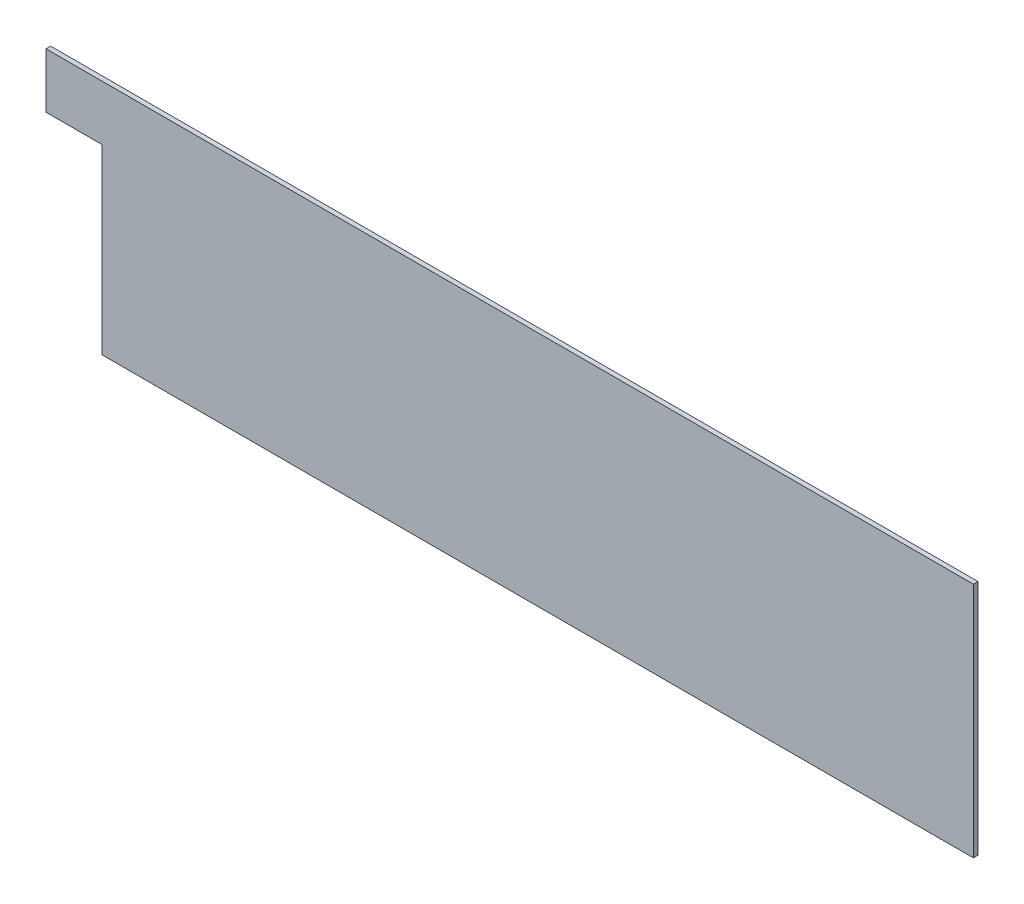
ISO-10303-21;
HEADER;
FILE_DESCRIPTION(('STEP AP214'),'2;1');
FILE_NAME('part.step','',(''),(''),'','','');
FILE_SCHEMA(('AUTOMOTIVE_DESIGN { 1 0 10303 214 1 1 1 1 }'));
ENDSEC;
DATA;
#1=APPLICATION_CONTEXT('core data for automotive mechanical design processes');
#2=APPLICATION_PROTOCOL_DEFINITION('international standard','automotive_design',2000,#1);
#3=PRODUCT_CONTEXT('',#1,'mechanical');
#4=PRODUCT('Part','Part','',(#3));
#5=PRODUCT_RELATED_PRODUCT_CATEGORY('part','',(#4));
#6=PRODUCT_DEFINITION_FORMATION('','',#4);
#7=PRODUCT_DEFINITION_CONTEXT('part definition',#1,'design');
#8=PRODUCT_DEFINITION('design','',#6,#7);
#9=PRODUCT_DEFINITION_SHAPE('','',#8);
#10=(LENGTH_UNIT() NAMED_UNIT(*) SI_UNIT(.MILLI.,.METRE.));
#11=(NAMED_UNIT(*) PLANE_ANGLE_UNIT() SI_UNIT($,.RADIAN.));
#12=(NAMED_UNIT(*) SI_UNIT($,.STERADIAN.) SOLID_ANGLE_UNIT());
#13=UNCERTAINTY_MEASURE_WITH_UNIT(LENGTH_MEASURE(1.E-05),#10,'distance_accuracy_value','');
#14=(GEOMETRIC_REPRESENTATION_CONTEXT(3) GLOBAL_UNCERTAINTY_ASSIGNED_CONTEXT((#13)) GLOBAL_UNIT_ASSIGNED_CONTEXT((#10,
#11,#12)) REPRESENTATION_CONTEXT('',''));
#15=CARTESIAN_POINT('',(0.,0.,0.));
#16=DIRECTION('',(0.,0.,1.));
#17=DIRECTION('',(1.,0.,0.));
#18=AXIS2_PLACEMENT_3D('',#15,#16,#17);
#19=CARTESIAN_POINT('',(6025.,-1.33622893420292E-13,-30.));
#20=DIRECTION('',(0.,1.,0.));
#21=DIRECTION('',(-1.,0.,0.));
#22=AXIS2_PLACEMENT_3D('',#19,#20,#21);
#23=PLANE('',#22);
#24=DIRECTION('',(-1.,0.,0.));
#25=VECTOR('',#24,1.);
#26=CARTESIAN_POINT('',(6025.,-1.33622893420292E-13,0.));
#27=LINE('',#26,#25);
#28=CARTESIAN_POINT('',(6025.,-1.33622893420292E-13,0.));
#29=VERTEX_POINT('',#28);
#30=CARTESIAN_POINT('',(0.,0.,0.));
#31=VERTEX_POINT('',#30);
#32=EDGE_CURVE('E118',#29,#31,#27,.T.);
#33=ORIENTED_EDGE('',*,*,#32,.F.);
#34=DIRECTION('',(0.,0.,1.));
#35=VECTOR('',#34,1.);
#36=CARTESIAN_POINT('',(6025.,-1.33622893420292E-13,-30.));
#37=LINE('',#36,#35);
#38=CARTESIAN_POINT('',(6025.,-1.33622893420292E-13,-30.));
#39=VERTEX_POINT('',#38);
#40=EDGE_CURVE('E45',#39,#29,#37,.T.);
#41=ORIENTED_EDGE('',*,*,#40,.F.);
#42=DIRECTION('',(-1.,0.,0.));
#43=VECTOR('',#42,1.);
#44=CARTESIAN_POINT('',(6025.,-1.33622893420292E-13,-30.));
#45=LINE('',#44,#43);
#46=CARTESIAN_POINT('',(0.,0.,-30.));
#47=VERTEX_POINT('',#46);
#48=EDGE_CURVE('E120',#39,#47,#45,.T.);
#49=ORIENTED_EDGE('',*,*,#48,.T.);
#50=DIRECTION('',(0.,0.,1.));
#51=VECTOR('',#50,1.);
#52=CARTESIAN_POINT('',(0.,0.,-30.));
#53=LINE('',#52,#51);
#54=EDGE_CURVE('E85',#47,#31,#53,.T.);
#55=ORIENTED_EDGE('',*,*,#54,.T.);
#56=EDGE_LOOP('',(#33,#41,#49,#55));
#57=FACE_BOUND('',#56,.T.);
#58=ADVANCED_FACE('F38',(#57),#23,.T.);
#59=CARTESIAN_POINT('',(6025.,-1540.,-30.));
#60=DIRECTION('',(1.,0.,0.));
#61=DIRECTION('',(0.,0.,-1.));
#62=AXIS2_PLACEMENT_3D('',#59,#60,#61);
#63=PLANE('',#62);
#64=DIRECTION('',(0.,1.,0.));
#65=VECTOR('',#64,1.);
#66=CARTESIAN_POINT('',(6025.,-1540.,0.));
#67=LINE('',#66,#65);
#68=CARTESIAN_POINT('',(6025.,-1540.,0.));
#69=VERTEX_POINT('',#68);
#70=EDGE_CURVE('E122',#69,#29,#67,.T.);
#71=ORIENTED_EDGE('',*,*,#70,.F.);
#72=DIRECTION('',(0.,0.,1.));
#73=VECTOR('',#72,1.);
#74=CARTESIAN_POINT('',(6025.,-1540.,-30.));
#75=LINE('',#74,#73);
#76=CARTESIAN_POINT('',(6025.,-1540.,-30.));
#77=VERTEX_POINT('',#76);
#78=EDGE_CURVE('E139',#77,#69,#75,.T.);
#79=ORIENTED_EDGE('',*,*,#78,.F.);
#80=DIRECTION('',(0.,1.,0.));
#81=VECTOR('',#80,1.);
#82=CARTESIAN_POINT('',(6025.,-1540.,-30.));
#83=LINE('',#82,#81);
#84=EDGE_CURVE('E125',#77,#39,#83,.T.);
#85=ORIENTED_EDGE('',*,*,#84,.T.);
#86=ORIENTED_EDGE('',*,*,#40,.T.);
#87=EDGE_LOOP('',(#71,#79,#85,#86));
#88=FACE_BOUND('',#87,.T.);
#89=ADVANCED_FACE('F146',(#88),#63,.T.);
#90=CARTESIAN_POINT('',(365.,-1540.,-30.));
#91=DIRECTION('',(0.,-1.,0.));
#92=DIRECTION('',(0.,0.,-1.));
#93=AXIS2_PLACEMENT_3D('',#90,#91,#92);
#94=PLANE('',#93);
#95=DIRECTION('',(1.,0.,0.));
#96=VECTOR('',#95,1.);
#97=CARTESIAN_POINT('',(365.,-1540.,0.));
#98=LINE('',#97,#96);
#99=CARTESIAN_POINT('',(365.,-1540.,0.));
#100=VERTEX_POINT('',#99);
#101=EDGE_CURVE('E133',#100,#69,#98,.T.);
#102=ORIENTED_EDGE('',*,*,#101,.F.);
#103=DIRECTION('',(0.,0.,1.));
#104=VECTOR('',#103,1.);
#105=CARTESIAN_POINT('',(365.,-1540.,-30.));
#106=LINE('',#105,#104);
#107=CARTESIAN_POINT('',(365.,-1540.,-30.));
#108=VERTEX_POINT('',#107);
#109=EDGE_CURVE('E141',#108,#100,#106,.T.);
#110=ORIENTED_EDGE('',*,*,#109,.F.);
#111=DIRECTION('',(1.,0.,0.));
#112=VECTOR('',#111,1.);
#113=CARTESIAN_POINT('',(365.,-1540.,-30.));
#114=LINE('',#113,#112);
#115=EDGE_CURVE('E105',#108,#77,#114,.T.);
#116=ORIENTED_EDGE('',*,*,#115,.T.);
#117=ORIENTED_EDGE('',*,*,#78,.T.);
#118=EDGE_LOOP('',(#102,#110,#116,#117));
#119=FACE_BOUND('',#118,.T.);
#120=ADVANCED_FACE('F148',(#119),#94,.T.);
#121=CARTESIAN_POINT('',(365.,-1015.,-30.));
#122=DIRECTION('',(-1.,0.,0.));
#123=DIRECTION('',(0.,-1.,0.));
#124=AXIS2_PLACEMENT_3D('',#121,#122,#123);
#125=PLANE('',#124);
#126=DIRECTION('',(0.,-1.,0.));
#127=VECTOR('',#126,1.);
#128=CARTESIAN_POINT('',(365.,-1015.,0.));
#129=LINE('',#128,#127);
#130=CARTESIAN_POINT('',(365.,-357.,0.));
#131=VERTEX_POINT('',#130);
#132=EDGE_CURVE('E52',#131,#100,#129,.T.);
#133=ORIENTED_EDGE('',*,*,#132,.F.);
#134=DIRECTION('',(0.,0.,1.));
#135=VECTOR('',#134,1.);
#136=CARTESIAN_POINT('',(365.,-357.,-30.));
#137=LINE('',#136,#135);
#138=CARTESIAN_POINT('',(365.,-357.,-30.));
#139=VERTEX_POINT('',#138);
#140=EDGE_CURVE('E108',#139,#131,#137,.T.);
#141=ORIENTED_EDGE('',*,*,#140,.F.);
#142=DIRECTION('',(0.,-1.,0.));
#143=VECTOR('',#142,1.);
#144=CARTESIAN_POINT('',(365.,-1015.,-30.));
#145=LINE('',#144,#143);
#146=EDGE_CURVE('E99',#139,#108,#145,.T.);
#147=ORIENTED_EDGE('',*,*,#146,.T.);
#148=ORIENTED_EDGE('',*,*,#109,.T.);
#149=EDGE_LOOP('',(#133,#141,#147,#148));
#150=FACE_BOUND('',#149,.T.);
#151=ADVANCED_FACE('F109',(#150),#125,.T.);
#152=CARTESIAN_POINT('',(0.,0.,-30.));
#153=DIRECTION('',(-1.,0.,0.));
#154=DIRECTION('',(0.,0.,1.));
#155=AXIS2_PLACEMENT_3D('',#152,#153,#154);
#156=PLANE('',#155);
#157=DIRECTION('',(0.,0.,1.));
#158=VECTOR('',#157,1.);
#159=CARTESIAN_POINT('',(0.,-357.,-30.));
#160=LINE('',#159,#158);
#161=CARTESIAN_POINT('',(0.,-357.,-30.));
#162=VERTEX_POINT('',#161);
#163=CARTESIAN_POINT('',(0.,-357.,0.));
#164=VERTEX_POINT('',#163);
#165=EDGE_CURVE('E112',#162,#164,#160,.T.);
#166=ORIENTED_EDGE('',*,*,#165,.T.);
#167=DIRECTION('',(0.,-1.,0.));
#168=VECTOR('',#167,1.);
#169=CARTESIAN_POINT('',(0.,0.,0.));
#170=LINE('',#169,#168);
#171=EDGE_CURVE('E129',#31,#164,#170,.T.);
#172=ORIENTED_EDGE('',*,*,#171,.F.);
#173=ORIENTED_EDGE('',*,*,#54,.F.);
#174=DIRECTION('',(0.,-1.,0.));
#175=VECTOR('',#174,1.);
#176=CARTESIAN_POINT('',(0.,0.,-30.));
#177=LINE('',#176,#175);
#178=EDGE_CURVE('E106',#47,#162,#177,.T.);
#179=ORIENTED_EDGE('',*,*,#178,.T.);
#180=EDGE_LOOP('',(#166,#172,#173,#179));
#181=FACE_BOUND('',#180,.T.);
#182=ADVANCED_FACE('F142',(#181),#156,.T.);
#183=CARTESIAN_POINT('',(0.,0.,-30.));
#184=DIRECTION('',(0.,0.,1.));
#185=DIRECTION('',(1.,0.,0.));
#186=AXIS2_PLACEMENT_3D('',#183,#184,#185);
#187=PLANE('',#186);
#188=ORIENTED_EDGE('',*,*,#146,.F.);
#189=DIRECTION('',(-1.,0.,0.));
#190=VECTOR('',#189,1.);
#191=CARTESIAN_POINT('',(365.,-357.,-30.));
#192=LINE('',#191,#190);
#193=EDGE_CURVE('E102',#139,#162,#192,.T.);
#194=ORIENTED_EDGE('',*,*,#193,.T.);
#195=ORIENTED_EDGE('',*,*,#178,.F.);
#196=ORIENTED_EDGE('',*,*,#48,.F.);
#197=ORIENTED_EDGE('',*,*,#84,.F.);
#198=ORIENTED_EDGE('',*,*,#115,.F.);
#199=EDGE_LOOP('',(#188,#194,#195,#196,#197,#198));
#200=FACE_BOUND('',#199,.T.);
#201=ADVANCED_FACE('F100',(#200),#187,.F.);
#202=CARTESIAN_POINT('',(0.,0.,0.));
#203=DIRECTION('',(0.,0.,1.));
#204=DIRECTION('',(1.,0.,0.));
#205=AXIS2_PLACEMENT_3D('',#202,#203,#204);
#206=PLANE('',#205);
#207=DIRECTION('',(-1.,0.,0.));
#208=VECTOR('',#207,1.);
#209=CARTESIAN_POINT('',(0.,-357.,0.));
#210=LINE('',#209,#208);
#211=EDGE_CURVE('E11',#131,#164,#210,.T.);
#212=ORIENTED_EDGE('',*,*,#211,.F.);
#213=ORIENTED_EDGE('',*,*,#132,.T.);
#214=ORIENTED_EDGE('',*,*,#101,.T.);
#215=ORIENTED_EDGE('',*,*,#70,.T.);
#216=ORIENTED_EDGE('',*,*,#32,.T.);
#217=ORIENTED_EDGE('',*,*,#171,.T.);
#218=EDGE_LOOP('',(#212,#213,#214,#215,#216,#217));
#219=FACE_BOUND('',#218,.T.);
#220=ADVANCED_FACE('F144',(#219),#206,.T.);
#221=CARTESIAN_POINT('',(365.,-357.,-30.));
#222=DIRECTION('',(0.,1.,0.));
#223=DIRECTION('',(-1.,0.,0.));
#224=AXIS2_PLACEMENT_3D('',#221,#222,#223);
#225=PLANE('',#224);
#226=ORIENTED_EDGE('',*,*,#211,.T.);
#227=ORIENTED_EDGE('',*,*,#165,.F.);
#228=ORIENTED_EDGE('',*,*,#193,.F.);
#229=ORIENTED_EDGE('',*,*,#140,.T.);
#230=EDGE_LOOP('',(#226,#227,#228,#229));
#231=FACE_BOUND('',#230,.T.);
#232=ADVANCED_FACE('F114',(#231),#225,.F.);
#233=CLOSED_SHELL('',(#58,#89,#120,#151,#182,#201,#220,#232));
#234=MANIFOLD_SOLID_BREP('B2',#233);
#235=ADVANCED_BREP_SHAPE_REPRESENTATION('',(#18,#234),#14);
#236=SHAPE_DEFINITION_REPRESENTATION(#9,#235);
ENDSEC;
END-ISO-10303-21;
